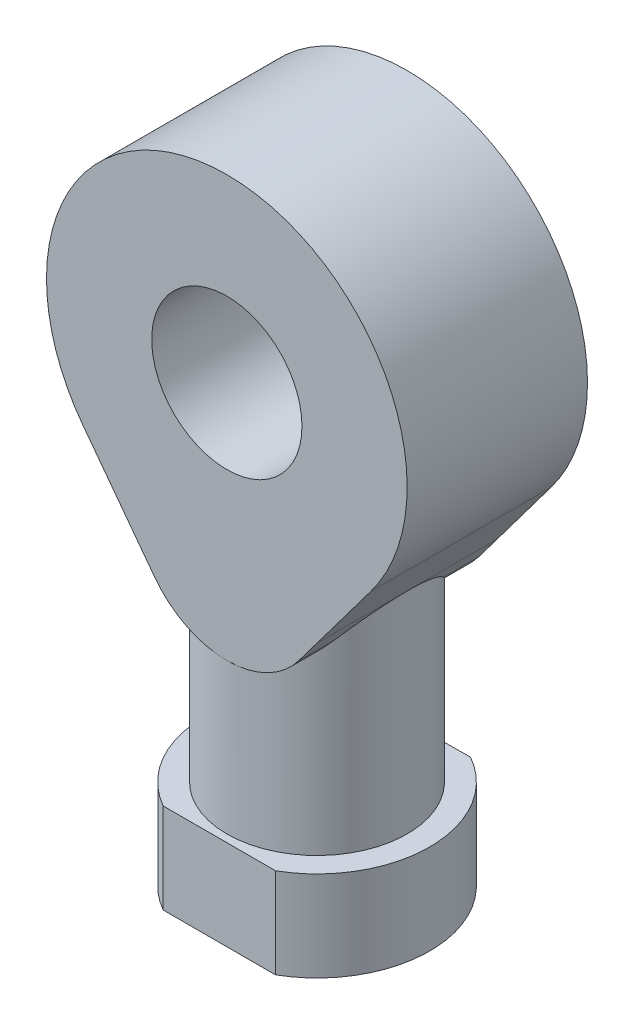
ISO-10303-21;
HEADER;
FILE_DESCRIPTION(('STEP AP214'),'2;1');
FILE_NAME('part.step','',(''),(''),'','','');
FILE_SCHEMA(('AUTOMOTIVE_DESIGN { 1 0 10303 214 1 1 1 1 }'));
ENDSEC;
DATA;
#1=APPLICATION_CONTEXT('core data for automotive mechanical design processes');
#2=APPLICATION_PROTOCOL_DEFINITION('international standard','automotive_design',2000,#1);
#3=PRODUCT_CONTEXT('',#1,'mechanical');
#4=PRODUCT('Part','Part','',(#3));
#5=PRODUCT_RELATED_PRODUCT_CATEGORY('part','',(#4));
#6=PRODUCT_DEFINITION_FORMATION('','',#4);
#7=PRODUCT_DEFINITION_CONTEXT('part definition',#1,'design');
#8=PRODUCT_DEFINITION('design','',#6,#7);
#9=PRODUCT_DEFINITION_SHAPE('','',#8);
#10=(LENGTH_UNIT() NAMED_UNIT(*) SI_UNIT(.MILLI.,.METRE.));
#11=(NAMED_UNIT(*) PLANE_ANGLE_UNIT() SI_UNIT($,.RADIAN.));
#12=(NAMED_UNIT(*) SI_UNIT($,.STERADIAN.) SOLID_ANGLE_UNIT());
#13=UNCERTAINTY_MEASURE_WITH_UNIT(LENGTH_MEASURE(1.E-05),#10,'distance_accuracy_value','');
#14=(GEOMETRIC_REPRESENTATION_CONTEXT(3) GLOBAL_UNCERTAINTY_ASSIGNED_CONTEXT((#13)) GLOBAL_UNIT_ASSIGNED_CONTEXT((#10,
#11,#12)) REPRESENTATION_CONTEXT('',''));
#15=CARTESIAN_POINT('',(0.,0.,0.));
#16=DIRECTION('',(0.,0.,1.));
#17=DIRECTION('',(1.,0.,0.));
#18=AXIS2_PLACEMENT_3D('',#15,#16,#17);
#19=CARTESIAN_POINT('',(0.,20.,0.));
#20=DIRECTION('',(0.,-1.,0.));
#21=DIRECTION('',(0.,0.,-1.));
#22=AXIS2_PLACEMENT_3D('',#19,#20,#21);
#23=CYLINDRICAL_SURFACE('',#22,6.);
#24=CARTESIAN_POINT('',(0.,6.,0.));
#25=DIRECTION('',(0.,1.,0.));
#26=DIRECTION('',(0.,0.,1.));
#27=AXIS2_PLACEMENT_3D('',#24,#25,#26);
#28=CIRCLE('',#27,6.);
#29=CARTESIAN_POINT('',(0.,6.,6.));
#30=VERTEX_POINT('',#29);
#31=EDGE_CURVE('E220',#30,#30,#28,.T.);
#32=ORIENTED_EDGE('',*,*,#31,.T.);
#33=EDGE_LOOP('',(#32));
#34=FACE_BOUND('',#33,.T.);
#35=CARTESIAN_POINT('',(0.,21.9999325605308,0.));
#36=DIRECTION('',(0.,-0.707106781186547,0.707106781186547));
#37=DIRECTION('',(0.,-0.707106781186547,-0.707106781186547));
#38=AXIS2_PLACEMENT_3D('',#35,#36,#37);
#39=ELLIPSE('',#38,8.48528137423857,6.);
#40=CARTESIAN_POINT('',(-4.80007283388993,18.4000296744307,-3.59990288610012));
#41=VERTEX_POINT('',#40);
#42=CARTESIAN_POINT('',(0.,15.9999325605308,-6.));
#43=VERTEX_POINT('',#42);
#44=EDGE_CURVE('E36',#41,#43,#39,.T.);
#45=ORIENTED_EDGE('',*,*,#44,.T.);
#46=CARTESIAN_POINT('',(4.80007283388993,18.4000296744307,-3.59990288610011));
#47=VERTEX_POINT('',#46);
#48=EDGE_CURVE('E11',#43,#47,#39,.T.);
#49=ORIENTED_EDGE('',*,*,#48,.T.);
#50=CARTESIAN_POINT('',(0.,11.9996627924207,0.));
#51=DIRECTION('',(0.800012138981649,-0.599983814350027,0.));
#52=DIRECTION('',(-0.599983814350027,-0.800012138981649,0.));
#53=AXIS2_PLACEMENT_3D('',#50,#51,#52);
#54=ELLIPSE('',#53,10.0002697681102,6.);
#55=CARTESIAN_POINT('',(6.,20.,0.));
#56=VERTEX_POINT('',#55);
#57=EDGE_CURVE('E215',#47,#56,#54,.T.);
#58=ORIENTED_EDGE('',*,*,#57,.T.);
#59=CARTESIAN_POINT('',(4.80007283388993,18.4000296744307,3.59990288610011));
#60=VERTEX_POINT('',#59);
#61=EDGE_CURVE('E200',#56,#60,#54,.T.);
#62=ORIENTED_EDGE('',*,*,#61,.T.);
#63=CARTESIAN_POINT('',(0.,21.9999325605308,0.));
#64=DIRECTION('',(0.,-0.707106781186547,-0.707106781186547));
#65=DIRECTION('',(0.,-0.707106781186547,0.707106781186547));
#66=AXIS2_PLACEMENT_3D('',#63,#64,#65);
#67=ELLIPSE('',#66,8.48528137423857,6.);
#68=CARTESIAN_POINT('',(0.,15.9999325605308,6.));
#69=VERTEX_POINT('',#68);
#70=EDGE_CURVE('E41',#60,#69,#67,.T.);
#71=ORIENTED_EDGE('',*,*,#70,.T.);
#72=CARTESIAN_POINT('',(-4.80007283388993,18.4000296744307,3.59990288610011));
#73=VERTEX_POINT('',#72);
#74=EDGE_CURVE('E245',#69,#73,#67,.T.);
#75=ORIENTED_EDGE('',*,*,#74,.T.);
#76=CARTESIAN_POINT('',(0.,11.9996627924207,0.));
#77=DIRECTION('',(-0.800012138981649,-0.599983814350027,0.));
#78=DIRECTION('',(0.599983814350027,-0.800012138981649,0.));
#79=AXIS2_PLACEMENT_3D('',#76,#77,#78);
#80=ELLIPSE('',#79,10.0002697681102,6.);
#81=CARTESIAN_POINT('',(-6.,20.,0.));
#82=VERTEX_POINT('',#81);
#83=EDGE_CURVE('E219',#73,#82,#80,.T.);
#84=ORIENTED_EDGE('',*,*,#83,.T.);
#85=EDGE_CURVE('E216',#82,#41,#80,.T.);
#86=ORIENTED_EDGE('',*,*,#85,.T.);
#87=EDGE_LOOP('',(#45,#49,#58,#62,#71,#75,#84,#86));
#88=FACE_BOUND('',#87,.T.);
#89=ADVANCED_FACE('F32',(#34,#88),#23,.T.);
#90=CARTESIAN_POINT('',(0.,6.,0.));
#91=DIRECTION('',(0.,1.,0.));
#92=DIRECTION('',(0.,0.,1.));
#93=AXIS2_PLACEMENT_3D('',#90,#91,#92);
#94=PLANE('',#93);
#95=CARTESIAN_POINT('',(0.,6.,0.));
#96=DIRECTION('',(0.,1.,0.));
#97=DIRECTION('',(0.,0.,1.));
#98=AXIS2_PLACEMENT_3D('',#95,#96,#97);
#99=CIRCLE('',#98,7.49999999999998);
#100=CARTESIAN_POINT('',(-3.80541245972622,6.,-6.46288140161645));
#101=VERTEX_POINT('',#100);
#102=CARTESIAN_POINT('',(-3.74165738677394,6.,6.5));
#103=VERTEX_POINT('',#102);
#104=EDGE_CURVE('E224',#101,#103,#99,.T.);
#105=ORIENTED_EDGE('',*,*,#104,.T.);
#106=DIRECTION('',(1.,0.,0.));
#107=VECTOR('',#106,1.);
#108=CARTESIAN_POINT('',(-3.74165738677394,6.,6.5));
#109=LINE('',#108,#107);
#110=CARTESIAN_POINT('',(3.74165738677394,6.,6.5));
#111=VERTEX_POINT('',#110);
#112=EDGE_CURVE('E86',#103,#111,#109,.T.);
#113=ORIENTED_EDGE('',*,*,#112,.T.);
#114=CARTESIAN_POINT('',(0.,6.,0.));
#115=DIRECTION('',(0.,1.,0.));
#116=DIRECTION('',(0.,0.,1.));
#117=AXIS2_PLACEMENT_3D('',#114,#115,#116);
#118=CIRCLE('',#117,7.50000000000002);
#119=CARTESIAN_POINT('',(3.67754028770424,6.,-6.53648968731019));
#120=VERTEX_POINT('',#119);
#121=EDGE_CURVE('E227',#111,#120,#118,.T.);
#122=ORIENTED_EDGE('',*,*,#121,.T.);
#123=DIRECTION('',(-0.999951622225128,0.,0.00983632092477937));
#124=VECTOR('',#123,1.);
#125=CARTESIAN_POINT('',(-3.80541245972622,6.,-6.46288140161645));
#126=LINE('',#125,#124);
#127=EDGE_CURVE('E57',#120,#101,#126,.T.);
#128=ORIENTED_EDGE('',*,*,#127,.T.);
#129=EDGE_LOOP('',(#105,#113,#122,#128));
#130=FACE_BOUND('',#129,.T.);
#131=ORIENTED_EDGE('',*,*,#31,.F.);
#132=EDGE_LOOP('',(#131));
#133=FACE_BOUND('',#132,.T.);
#134=ADVANCED_FACE('F295',(#130,#133),#94,.T.);
#135=CARTESIAN_POINT('',(0.,6.,0.));
#136=DIRECTION('',(0.,-1.,0.));
#137=DIRECTION('',(0.,0.,-1.));
#138=AXIS2_PLACEMENT_3D('',#135,#136,#137);
#139=CYLINDRICAL_SURFACE('',#138,7.49999999999998);
#140=CARTESIAN_POINT('',(0.,0.,0.));
#141=DIRECTION('',(0.,1.,0.));
#142=DIRECTION('',(0.,0.,1.));
#143=AXIS2_PLACEMENT_3D('',#140,#141,#142);
#144=CIRCLE('',#143,7.49999999999998);
#145=CARTESIAN_POINT('',(-3.80541245972622,0.,-6.46288140161645));
#146=VERTEX_POINT('',#145);
#147=CARTESIAN_POINT('',(-3.74165738677394,0.,6.5));
#148=VERTEX_POINT('',#147);
#149=EDGE_CURVE('E223',#146,#148,#144,.T.);
#150=ORIENTED_EDGE('',*,*,#149,.T.);
#151=DIRECTION('',(0.,-1.,0.));
#152=VECTOR('',#151,1.);
#153=CARTESIAN_POINT('',(-3.74165738677394,6.,6.5));
#154=LINE('',#153,#152);
#155=EDGE_CURVE('E244',#103,#148,#154,.T.);
#156=ORIENTED_EDGE('',*,*,#155,.F.);
#157=ORIENTED_EDGE('',*,*,#104,.F.);
#158=DIRECTION('',(0.,-1.,0.));
#159=VECTOR('',#158,1.);
#160=CARTESIAN_POINT('',(-3.80541245972622,6.,-6.46288140161645));
#161=LINE('',#160,#159);
#162=EDGE_CURVE('E230',#101,#146,#161,.T.);
#163=ORIENTED_EDGE('',*,*,#162,.T.);
#164=EDGE_LOOP('',(#150,#156,#157,#163));
#165=FACE_BOUND('',#164,.T.);
#166=ADVANCED_FACE('F34',(#165),#139,.T.);
#167=CARTESIAN_POINT('',(-3.74165738677394,6.,6.5));
#168=DIRECTION('',(0.,0.,-1.));
#169=DIRECTION('',(-1.,0.,0.));
#170=AXIS2_PLACEMENT_3D('',#167,#168,#169);
#171=PLANE('',#170);
#172=DIRECTION('',(1.,0.,0.));
#173=VECTOR('',#172,1.);
#174=CARTESIAN_POINT('',(-3.74165738677394,0.,6.5));
#175=LINE('',#174,#173);
#176=CARTESIAN_POINT('',(3.74165738677394,0.,6.5));
#177=VERTEX_POINT('',#176);
#178=EDGE_CURVE('E233',#148,#177,#175,.T.);
#179=ORIENTED_EDGE('',*,*,#178,.T.);
#180=DIRECTION('',(0.,-1.,0.));
#181=VECTOR('',#180,1.);
#182=CARTESIAN_POINT('',(3.74165738677394,6.,6.5));
#183=LINE('',#182,#181);
#184=EDGE_CURVE('E241',#111,#177,#183,.T.);
#185=ORIENTED_EDGE('',*,*,#184,.F.);
#186=ORIENTED_EDGE('',*,*,#112,.F.);
#187=ORIENTED_EDGE('',*,*,#155,.T.);
#188=EDGE_LOOP('',(#179,#185,#186,#187));
#189=FACE_BOUND('',#188,.T.);
#190=ADVANCED_FACE('F310',(#189),#171,.F.);
#191=CARTESIAN_POINT('',(0.,6.,0.));
#192=DIRECTION('',(0.,-1.,0.));
#193=DIRECTION('',(0.,0.,-1.));
#194=AXIS2_PLACEMENT_3D('',#191,#192,#193);
#195=CYLINDRICAL_SURFACE('',#194,7.50000000000002);
#196=CARTESIAN_POINT('',(0.,0.,0.));
#197=DIRECTION('',(0.,1.,0.));
#198=DIRECTION('',(0.,0.,1.));
#199=AXIS2_PLACEMENT_3D('',#196,#197,#198);
#200=CIRCLE('',#199,7.50000000000002);
#201=CARTESIAN_POINT('',(3.67754028770424,0.,-6.53648968731019));
#202=VERTEX_POINT('',#201);
#203=EDGE_CURVE('E235',#177,#202,#200,.T.);
#204=ORIENTED_EDGE('',*,*,#203,.T.);
#205=DIRECTION('',(0.,-1.,0.));
#206=VECTOR('',#205,1.);
#207=CARTESIAN_POINT('',(3.67754028770424,6.,-6.53648968731019));
#208=LINE('',#207,#206);
#209=EDGE_CURVE('E239',#120,#202,#208,.T.);
#210=ORIENTED_EDGE('',*,*,#209,.F.);
#211=ORIENTED_EDGE('',*,*,#121,.F.);
#212=ORIENTED_EDGE('',*,*,#184,.T.);
#213=EDGE_LOOP('',(#204,#210,#211,#212));
#214=FACE_BOUND('',#213,.T.);
#215=ADVANCED_FACE('F308',(#214),#195,.T.);
#216=CARTESIAN_POINT('',(-3.80541245972622,6.,-6.46288140161645));
#217=DIRECTION('',(0.00983632092477937,0.,0.999951622225128));
#218=DIRECTION('',(0.999951622225128,0.,-0.00983632092477937));
#219=AXIS2_PLACEMENT_3D('',#216,#217,#218);
#220=PLANE('',#219);
#221=DIRECTION('',(-0.999951622225128,0.,0.00983632092477937));
#222=VECTOR('',#221,1.);
#223=CARTESIAN_POINT('',(-3.80541245972622,0.,-6.46288140161645));
#224=LINE('',#223,#222);
#225=EDGE_CURVE('E78',#202,#146,#224,.T.);
#226=ORIENTED_EDGE('',*,*,#225,.T.);
#227=ORIENTED_EDGE('',*,*,#162,.F.);
#228=ORIENTED_EDGE('',*,*,#127,.F.);
#229=ORIENTED_EDGE('',*,*,#209,.T.);
#230=EDGE_LOOP('',(#226,#227,#228,#229));
#231=FACE_BOUND('',#230,.T.);
#232=ADVANCED_FACE('F304',(#231),#220,.F.);
#233=CARTESIAN_POINT('',(0.,0.,0.));
#234=DIRECTION('',(0.,1.,0.));
#235=DIRECTION('',(0.,0.,1.));
#236=AXIS2_PLACEMENT_3D('',#233,#234,#235);
#237=PLANE('',#236);
#238=CARTESIAN_POINT('',(0.,0.,0.));
#239=DIRECTION('',(0.,-1.,0.));
#240=DIRECTION('',(0.,0.,-1.));
#241=AXIS2_PLACEMENT_3D('',#238,#239,#240);
#242=CIRCLE('',#241,4.9);
#243=CARTESIAN_POINT('',(0.,0.,-4.9));
#244=VERTEX_POINT('',#243);
#245=EDGE_CURVE('E477',#244,#244,#242,.T.);
#246=ORIENTED_EDGE('',*,*,#245,.F.);
#247=EDGE_LOOP('',(#246));
#248=FACE_BOUND('',#247,.T.);
#249=ORIENTED_EDGE('',*,*,#149,.F.);
#250=ORIENTED_EDGE('',*,*,#225,.F.);
#251=ORIENTED_EDGE('',*,*,#203,.F.);
#252=ORIENTED_EDGE('',*,*,#178,.F.);
#253=EDGE_LOOP('',(#249,#250,#251,#252));
#254=FACE_BOUND('',#253,.T.);
#255=ADVANCED_FACE('F292',(#248,#254),#237,.F.);
#256=CARTESIAN_POINT('',(0.,21.9999325605308,-6.));
#257=DIRECTION('',(0.,0.,1.));
#258=DIRECTION('',(1.,0.,0.));
#259=AXIS2_PLACEMENT_3D('',#256,#257,#258);
#260=CYLINDRICAL_SURFACE('',#259,6.);
#261=ORIENTED_EDGE('',*,*,#44,.F.);
#262=DIRECTION('',(0.,0.,1.));
#263=VECTOR('',#262,1.);
#264=CARTESIAN_POINT('',(-4.80007283388993,18.4000296744307,-6.));
#265=LINE('',#264,#263);
#266=CARTESIAN_POINT('',(-4.80007283388993,18.4000296744307,-6.));
#267=VERTEX_POINT('',#266);
#268=EDGE_CURVE('E197',#267,#41,#265,.T.);
#269=ORIENTED_EDGE('',*,*,#268,.F.);
#270=CARTESIAN_POINT('',(0.,21.9999325605308,-6.));
#271=DIRECTION('',(0.,0.,1.));
#272=DIRECTION('',(-1.,0.,0.));
#273=AXIS2_PLACEMENT_3D('',#270,#271,#272);
#274=CIRCLE('',#273,6.);
#275=EDGE_CURVE('E180',#267,#43,#274,.T.);
#276=ORIENTED_EDGE('',*,*,#275,.T.);
#277=EDGE_LOOP('',(#261,#269,#276));
#278=FACE_BOUND('',#277,.T.);
#279=ADVANCED_FACE('F282',(#278),#260,.T.);
#280=ORIENTED_EDGE('',*,*,#48,.F.);
#281=CARTESIAN_POINT('',(4.80007283388993,18.4000296744307,-6.));
#282=VERTEX_POINT('',#281);
#283=EDGE_CURVE('E179',#43,#282,#274,.T.);
#284=ORIENTED_EDGE('',*,*,#283,.T.);
#285=DIRECTION('',(0.,0.,1.));
#286=VECTOR('',#285,1.);
#287=CARTESIAN_POINT('',(4.80007283388993,18.4000296744307,-6.));
#288=LINE('',#287,#286);
#289=EDGE_CURVE('E149',#282,#47,#288,.T.);
#290=ORIENTED_EDGE('',*,*,#289,.T.);
#291=EDGE_LOOP('',(#280,#284,#290));
#292=FACE_BOUND('',#291,.T.);
#293=ADVANCED_FACE('F288',(#292),#260,.T.);
#294=ORIENTED_EDGE('',*,*,#70,.F.);
#295=CARTESIAN_POINT('',(4.80007283388993,18.4000296744307,6.));
#296=VERTEX_POINT('',#295);
#297=EDGE_CURVE('E48',#60,#296,#288,.T.);
#298=ORIENTED_EDGE('',*,*,#297,.T.);
#299=CARTESIAN_POINT('',(0.,21.9999325605308,6.));
#300=DIRECTION('',(0.,0.,1.));
#301=DIRECTION('',(-1.,0.,0.));
#302=AXIS2_PLACEMENT_3D('',#299,#300,#301);
#303=CIRCLE('',#302,6.);
#304=EDGE_CURVE('E145',#69,#296,#303,.T.);
#305=ORIENTED_EDGE('',*,*,#304,.F.);
#306=EDGE_LOOP('',(#294,#298,#305));
#307=FACE_BOUND('',#306,.T.);
#308=ADVANCED_FACE('F144',(#307),#260,.T.);
#309=ORIENTED_EDGE('',*,*,#74,.F.);
#310=CARTESIAN_POINT('',(-4.80007283388993,18.4000296744307,6.));
#311=VERTEX_POINT('',#310);
#312=EDGE_CURVE('E160',#311,#69,#303,.T.);
#313=ORIENTED_EDGE('',*,*,#312,.F.);
#314=EDGE_CURVE('E201',#73,#311,#265,.T.);
#315=ORIENTED_EDGE('',*,*,#314,.F.);
#316=EDGE_LOOP('',(#309,#313,#315));
#317=FACE_BOUND('',#316,.T.);
#318=ADVANCED_FACE('F279',(#317),#260,.T.);
#319=CARTESIAN_POINT('',(-6.,20.,-6.));
#320=DIRECTION('',(-0.800012138981649,-0.599983814350027,0.));
#321=DIRECTION('',(0.599983814350027,-0.800012138981649,0.));
#322=AXIS2_PLACEMENT_3D('',#319,#320,#321);
#323=PLANE('',#322);
#324=ORIENTED_EDGE('',*,*,#83,.F.);
#325=ORIENTED_EDGE('',*,*,#314,.T.);
#326=DIRECTION('',(0.599983814350027,-0.800012138981649,0.));
#327=VECTOR('',#326,1.);
#328=CARTESIAN_POINT('',(-6.,20.,6.));
#329=LINE('',#328,#327);
#330=CARTESIAN_POINT('',(-6.,20.,6.));
#331=VERTEX_POINT('',#330);
#332=EDGE_CURVE('E177',#331,#311,#329,.T.);
#333=ORIENTED_EDGE('',*,*,#332,.F.);
#334=DIRECTION('',(0.,0.,1.));
#335=VECTOR('',#334,1.);
#336=CARTESIAN_POINT('',(-6.,20.,-6.));
#337=LINE('',#336,#335);
#338=EDGE_CURVE('E205',#82,#331,#337,.T.);
#339=ORIENTED_EDGE('',*,*,#338,.F.);
#340=EDGE_LOOP('',(#324,#325,#333,#339));
#341=FACE_BOUND('',#340,.T.);
#342=ADVANCED_FACE('F276',(#341),#323,.T.);
#343=ORIENTED_EDGE('',*,*,#85,.F.);
#344=CARTESIAN_POINT('',(-6.,20.,-6.));
#345=VERTEX_POINT('',#344);
#346=EDGE_CURVE('E202',#345,#82,#337,.T.);
#347=ORIENTED_EDGE('',*,*,#346,.F.);
#348=DIRECTION('',(0.599983814350027,-0.800012138981649,0.));
#349=VECTOR('',#348,1.);
#350=CARTESIAN_POINT('',(-6.,20.,-6.));
#351=LINE('',#350,#349);
#352=EDGE_CURVE('E150',#345,#267,#351,.T.);
#353=ORIENTED_EDGE('',*,*,#352,.T.);
#354=ORIENTED_EDGE('',*,*,#268,.T.);
#355=EDGE_LOOP('',(#343,#347,#353,#354));
#356=FACE_BOUND('',#355,.T.);
#357=ADVANCED_FACE('F272',(#356),#323,.T.);
#358=CARTESIAN_POINT('',(4.80007283388993,18.4000296744307,-6.));
#359=DIRECTION('',(0.800012138981649,-0.599983814350027,0.));
#360=DIRECTION('',(0.599983814350027,0.800012138981649,0.));
#361=AXIS2_PLACEMENT_3D('',#358,#359,#360);
#362=PLANE('',#361);
#363=ORIENTED_EDGE('',*,*,#57,.F.);
#364=ORIENTED_EDGE('',*,*,#289,.F.);
#365=DIRECTION('',(0.599983814350027,0.800012138981649,0.));
#366=VECTOR('',#365,1.);
#367=CARTESIAN_POINT('',(4.80007283388993,18.4000296744307,-6.));
#368=LINE('',#367,#366);
#369=CARTESIAN_POINT('',(6.,20.,-6.));
#370=VERTEX_POINT('',#369);
#371=EDGE_CURVE('E183',#282,#370,#368,.T.);
#372=ORIENTED_EDGE('',*,*,#371,.T.);
#373=DIRECTION('',(0.,0.,1.));
#374=VECTOR('',#373,1.);
#375=CARTESIAN_POINT('',(6.,20.,-6.));
#376=LINE('',#375,#374);
#377=EDGE_CURVE('E210',#370,#56,#376,.T.);
#378=ORIENTED_EDGE('',*,*,#377,.T.);
#379=EDGE_LOOP('',(#363,#364,#372,#378));
#380=FACE_BOUND('',#379,.T.);
#381=ADVANCED_FACE('F255',(#380),#362,.T.);
#382=ORIENTED_EDGE('',*,*,#61,.F.);
#383=CARTESIAN_POINT('',(6.,20.,6.));
#384=VERTEX_POINT('',#383);
#385=EDGE_CURVE('E165',#56,#384,#376,.T.);
#386=ORIENTED_EDGE('',*,*,#385,.T.);
#387=DIRECTION('',(0.599983814350027,0.800012138981649,0.));
#388=VECTOR('',#387,1.);
#389=CARTESIAN_POINT('',(4.80007283388993,18.4000296744307,6.));
#390=LINE('',#389,#388);
#391=EDGE_CURVE('E156',#296,#384,#390,.T.);
#392=ORIENTED_EDGE('',*,*,#391,.F.);
#393=ORIENTED_EDGE('',*,*,#297,.F.);
#394=EDGE_LOOP('',(#382,#386,#392,#393));
#395=FACE_BOUND('',#394,.T.);
#396=ADVANCED_FACE('F163',(#395),#362,.T.);
#397=CARTESIAN_POINT('',(-6.,20.,-6.));
#398=DIRECTION('',(-0.800039441466121,-0.599947407777195,0.));
#399=DIRECTION('',(0.599947407777196,-0.800039441466121,0.));
#400=AXIS2_PLACEMENT_3D('',#397,#398,#399);
#401=PLANE('',#400);
#402=ORIENTED_EDGE('',*,*,#346,.T.);
#403=ORIENTED_EDGE('',*,*,#338,.T.);
#404=DIRECTION('',(0.599947407777196,-0.800039441466121,0.));
#405=VECTOR('',#404,1.);
#406=CARTESIAN_POINT('',(-6.,20.,6.));
#407=LINE('',#406,#405);
#408=CARTESIAN_POINT('',(-9.55153565638486,24.7360294686636,6.));
#409=VERTEX_POINT('',#408);
#410=EDGE_CURVE('E174',#409,#331,#407,.T.);
#411=ORIENTED_EDGE('',*,*,#410,.F.);
#412=DIRECTION('',(0.,0.,1.));
#413=VECTOR('',#412,1.);
#414=CARTESIAN_POINT('',(-9.55153565638486,24.7360294686636,-6.));
#415=LINE('',#414,#413);
#416=CARTESIAN_POINT('',(-9.55153565638486,24.7360294686636,-6.));
#417=VERTEX_POINT('',#416);
#418=EDGE_CURVE('E206',#417,#409,#415,.T.);
#419=ORIENTED_EDGE('',*,*,#418,.F.);
#420=DIRECTION('',(0.599947407777196,-0.800039441466121,0.));
#421=VECTOR('',#420,1.);
#422=CARTESIAN_POINT('',(-6.,20.,-6.));
#423=LINE('',#422,#421);
#424=EDGE_CURVE('E192',#417,#345,#423,.T.);
#425=ORIENTED_EDGE('',*,*,#424,.T.);
#426=EDGE_LOOP('',(#402,#403,#411,#419,#425));
#427=FACE_BOUND('',#426,.T.);
#428=ADVANCED_FACE('F269',(#427),#401,.T.);
#429=CARTESIAN_POINT('',(0.000151740084777634,32.,-6.));
#430=DIRECTION('',(0.,0.,1.));
#431=DIRECTION('',(1.,0.,0.));
#432=AXIS2_PLACEMENT_3D('',#429,#430,#431);
#433=CYLINDRICAL_SURFACE('',#432,12.);
#434=ORIENTED_EDGE('',*,*,#418,.T.);
#435=CARTESIAN_POINT('',(0.000151740084777634,32.,6.));
#436=DIRECTION('',(0.,0.,1.));
#437=DIRECTION('',(1.,0.,0.));
#438=AXIS2_PLACEMENT_3D('',#435,#436,#437);
#439=CIRCLE('',#438,12.);
#440=CARTESIAN_POINT('',(9.55183913655442,24.7360294686636,6.));
#441=VERTEX_POINT('',#440);
#442=EDGE_CURVE('E168',#441,#409,#439,.T.);
#443=ORIENTED_EDGE('',*,*,#442,.F.);
#444=DIRECTION('',(0.,0.,1.));
#445=VECTOR('',#444,1.);
#446=CARTESIAN_POINT('',(9.55183913655442,24.7360294686636,-6.));
#447=LINE('',#446,#445);
#448=CARTESIAN_POINT('',(9.55183913655442,24.7360294686636,-6.));
#449=VERTEX_POINT('',#448);
#450=EDGE_CURVE('E208',#449,#441,#447,.T.);
#451=ORIENTED_EDGE('',*,*,#450,.F.);
#452=CARTESIAN_POINT('',(0.000151740084777634,32.,-6.));
#453=DIRECTION('',(0.,0.,1.));
#454=DIRECTION('',(1.,0.,0.));
#455=AXIS2_PLACEMENT_3D('',#452,#453,#454);
#456=CIRCLE('',#455,12.);
#457=EDGE_CURVE('E189',#449,#417,#456,.T.);
#458=ORIENTED_EDGE('',*,*,#457,.T.);
#459=EDGE_LOOP('',(#434,#443,#451,#458));
#460=FACE_BOUND('',#459,.T.);
#461=ADVANCED_FACE('F267',(#460),#433,.T.);
#462=CARTESIAN_POINT('',(6.,20.,-6.));
#463=DIRECTION('',(0.800014834933655,-0.59998021957901,0.));
#464=DIRECTION('',(0.59998021957901,0.800014834933655,0.));
#465=AXIS2_PLACEMENT_3D('',#462,#463,#464);
#466=PLANE('',#465);
#467=ORIENTED_EDGE('',*,*,#450,.T.);
#468=DIRECTION('',(0.59998021957901,0.800014834933654,0.));
#469=VECTOR('',#468,1.);
#470=CARTESIAN_POINT('',(6.,20.,6.));
#471=LINE('',#470,#469);
#472=EDGE_CURVE('E166',#384,#441,#471,.T.);
#473=ORIENTED_EDGE('',*,*,#472,.F.);
#474=ORIENTED_EDGE('',*,*,#385,.F.);
#475=ORIENTED_EDGE('',*,*,#377,.F.);
#476=DIRECTION('',(0.59998021957901,0.800014834933654,0.));
#477=VECTOR('',#476,1.);
#478=CARTESIAN_POINT('',(6.,20.,-6.));
#479=LINE('',#478,#477);
#480=EDGE_CURVE('E186',#370,#449,#479,.T.);
#481=ORIENTED_EDGE('',*,*,#480,.T.);
#482=EDGE_LOOP('',(#467,#473,#474,#475,#481));
#483=FACE_BOUND('',#482,.T.);
#484=ADVANCED_FACE('F252',(#483),#466,.T.);
#485=CARTESIAN_POINT('',(0.,21.9999325605308,-6.));
#486=DIRECTION('',(0.,0.,-1.));
#487=DIRECTION('',(-1.,0.,0.));
#488=AXIS2_PLACEMENT_3D('',#485,#486,#487);
#489=PLANE('',#488);
#490=CARTESIAN_POINT('',(0.000151740084777634,32.,-6.));
#491=DIRECTION('',(0.,0.,-1.));
#492=DIRECTION('',(-1.,0.,0.));
#493=AXIS2_PLACEMENT_3D('',#490,#491,#492);
#494=CIRCLE('',#493,5.);
#495=CARTESIAN_POINT('',(-4.99984825991522,32.,-6.));
#496=VERTEX_POINT('',#495);
#497=EDGE_CURVE('E161',#496,#496,#494,.T.);
#498=ORIENTED_EDGE('',*,*,#497,.F.);
#499=EDGE_LOOP('',(#498));
#500=FACE_BOUND('',#499,.T.);
#501=ORIENTED_EDGE('',*,*,#283,.F.);
#502=ORIENTED_EDGE('',*,*,#275,.F.);
#503=ORIENTED_EDGE('',*,*,#352,.F.);
#504=ORIENTED_EDGE('',*,*,#424,.F.);
#505=ORIENTED_EDGE('',*,*,#457,.F.);
#506=ORIENTED_EDGE('',*,*,#480,.F.);
#507=ORIENTED_EDGE('',*,*,#371,.F.);
#508=EDGE_LOOP('',(#501,#502,#503,#504,#505,#506,#507));
#509=FACE_BOUND('',#508,.T.);
#510=ADVANCED_FACE('F260',(#500,#509),#489,.T.);
#511=CARTESIAN_POINT('',(0.,21.9999325605308,6.));
#512=DIRECTION('',(0.,0.,-1.));
#513=DIRECTION('',(-1.,0.,0.));
#514=AXIS2_PLACEMENT_3D('',#511,#512,#513);
#515=PLANE('',#514);
#516=CARTESIAN_POINT('',(0.000151740084777634,32.,6.));
#517=DIRECTION('',(0.,0.,1.));
#518=DIRECTION('',(1.,0.,0.));
#519=AXIS2_PLACEMENT_3D('',#516,#517,#518);
#520=CIRCLE('',#519,5.);
#521=CARTESIAN_POINT('',(5.00015174008478,32.,6.));
#522=VERTEX_POINT('',#521);
#523=EDGE_CURVE('E476',#522,#522,#520,.T.);
#524=ORIENTED_EDGE('',*,*,#523,.F.);
#525=EDGE_LOOP('',(#524));
#526=FACE_BOUND('',#525,.T.);
#527=ORIENTED_EDGE('',*,*,#312,.T.);
#528=ORIENTED_EDGE('',*,*,#304,.T.);
#529=ORIENTED_EDGE('',*,*,#391,.T.);
#530=ORIENTED_EDGE('',*,*,#472,.T.);
#531=ORIENTED_EDGE('',*,*,#442,.T.);
#532=ORIENTED_EDGE('',*,*,#410,.T.);
#533=ORIENTED_EDGE('',*,*,#332,.T.);
#534=EDGE_LOOP('',(#527,#528,#529,#530,#531,#532,#533));
#535=FACE_BOUND('',#534,.T.);
#536=ADVANCED_FACE('F154',(#526,#535),#515,.F.);
#537=CARTESIAN_POINT('',(0.000151740084777634,32.,-6.53648968731019));
#538=DIRECTION('',(0.,0.,1.));
#539=DIRECTION('',(1.,0.,0.));
#540=AXIS2_PLACEMENT_3D('',#537,#538,#539);
#541=CYLINDRICAL_SURFACE('',#540,5.);
#542=ORIENTED_EDGE('',*,*,#497,.T.);
#543=EDGE_LOOP('',(#542));
#544=FACE_BOUND('',#543,.T.);
#545=ORIENTED_EDGE('',*,*,#523,.T.);
#546=EDGE_LOOP('',(#545));
#547=FACE_BOUND('',#546,.T.);
#548=ADVANCED_FACE('F434',(#544,#547),#541,.F.);
#549=CARTESIAN_POINT('',(0.,20.,0.));
#550=DIRECTION('',(0.,-1.,0.));
#551=DIRECTION('',(0.,0.,-1.));
#552=AXIS2_PLACEMENT_3D('',#549,#550,#551);
#553=CYLINDRICAL_SURFACE('',#552,4.9);
#554=CARTESIAN_POINT('',(0.,20.,0.));
#555=DIRECTION('',(0.,-1.,0.));
#556=DIRECTION('',(0.,0.,-1.));
#557=AXIS2_PLACEMENT_3D('',#554,#555,#556);
#558=CIRCLE('',#557,4.9);
#559=CARTESIAN_POINT('',(0.,20.,-4.9));
#560=VERTEX_POINT('',#559);
#561=EDGE_CURVE('E475',#560,#560,#558,.T.);
#562=ORIENTED_EDGE('',*,*,#561,.F.);
#563=EDGE_LOOP('',(#562));
#564=FACE_BOUND('',#563,.T.);
#565=ORIENTED_EDGE('',*,*,#245,.T.);
#566=EDGE_LOOP('',(#565));
#567=FACE_BOUND('',#566,.T.);
#568=ADVANCED_FACE('F444',(#564,#567),#553,.F.);
#569=CARTESIAN_POINT('',(0.,20.,0.));
#570=DIRECTION('',(0.,-1.,0.));
#571=DIRECTION('',(0.,0.,-1.));
#572=AXIS2_PLACEMENT_3D('',#569,#570,#571);
#573=PLANE('',#572);
#574=ORIENTED_EDGE('',*,*,#561,.T.);
#575=EDGE_LOOP('',(#574));
#576=FACE_BOUND('',#575,.T.);
#577=ADVANCED_FACE('F459',(#576),#573,.T.);
#578=CLOSED_SHELL('',(#89,#134,#166,#190,#215,#232,#255,#279,#293,#308,#318,#342,#357,#381,#396,
#428,#461,#484,#510,#536,#548,#568,#577));
#579=MANIFOLD_SOLID_BREP('B2',#578);
#580=ADVANCED_BREP_SHAPE_REPRESENTATION('',(#18,#579),#14);
#581=SHAPE_DEFINITION_REPRESENTATION(#9,#580);
ENDSEC;
END-ISO-10303-21;
